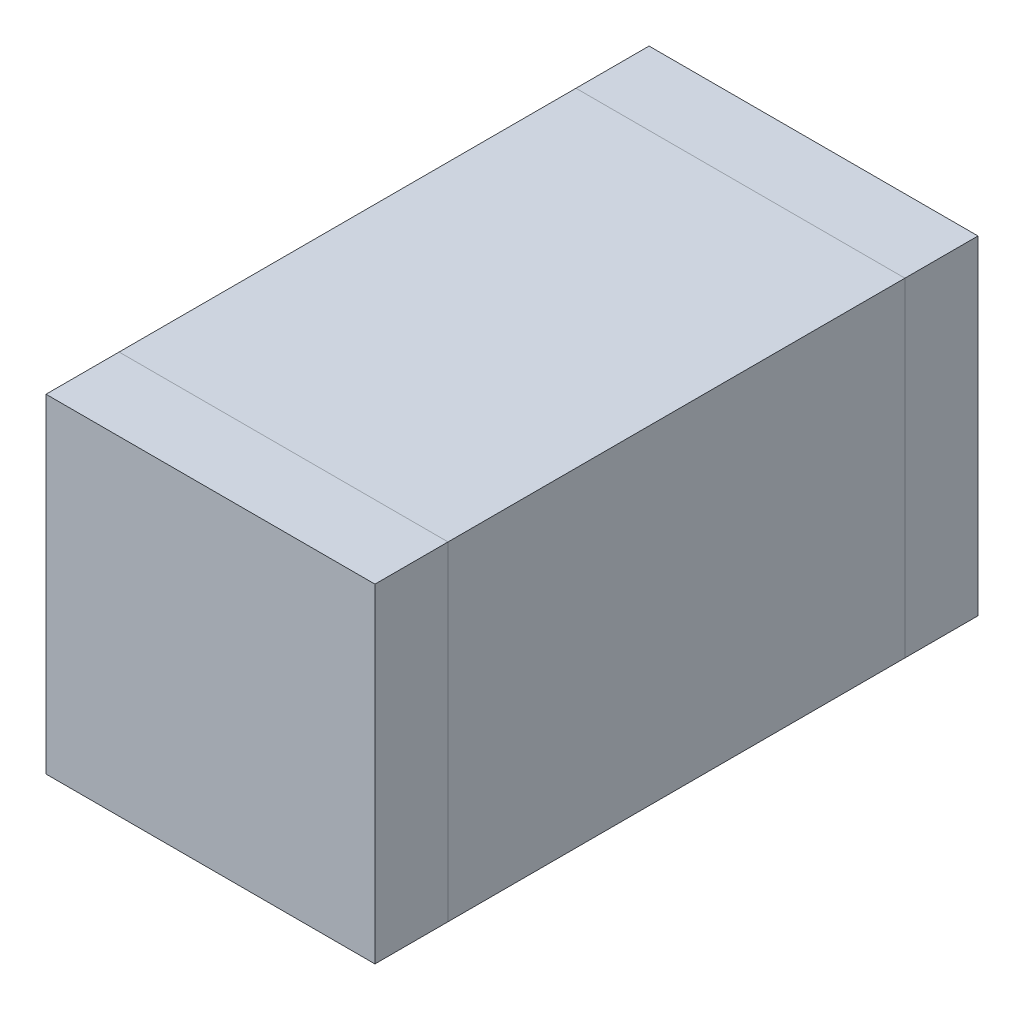
ISO-10303-21;
HEADER;
FILE_DESCRIPTION(('STEP AP214'),'2;1');
FILE_NAME('part.step','',(''),(''),'','','');
FILE_SCHEMA(('AUTOMOTIVE_DESIGN { 1 0 10303 214 1 1 1 1 }'));
ENDSEC;
DATA;
#1=APPLICATION_CONTEXT('core data for automotive mechanical design processes');
#2=APPLICATION_PROTOCOL_DEFINITION('international standard','automotive_design',2000,#1);
#3=PRODUCT_CONTEXT('',#1,'mechanical');
#4=PRODUCT('Part','Part','',(#3));
#5=PRODUCT_RELATED_PRODUCT_CATEGORY('part','',(#4));
#6=PRODUCT_DEFINITION_FORMATION('','',#4);
#7=PRODUCT_DEFINITION_CONTEXT('part definition',#1,'design');
#8=PRODUCT_DEFINITION('design','',#6,#7);
#9=PRODUCT_DEFINITION_SHAPE('','',#8);
#10=(LENGTH_UNIT() NAMED_UNIT(*) SI_UNIT(.MILLI.,.METRE.));
#11=(NAMED_UNIT(*) PLANE_ANGLE_UNIT() SI_UNIT($,.RADIAN.));
#12=(NAMED_UNIT(*) SI_UNIT($,.STERADIAN.) SOLID_ANGLE_UNIT());
#13=UNCERTAINTY_MEASURE_WITH_UNIT(LENGTH_MEASURE(1.E-05),#10,'distance_accuracy_value','');
#14=(GEOMETRIC_REPRESENTATION_CONTEXT(3) GLOBAL_UNCERTAINTY_ASSIGNED_CONTEXT((#13)) GLOBAL_UNIT_ASSIGNED_CONTEXT((#10,
#11,#12)) REPRESENTATION_CONTEXT('',''));
#15=CARTESIAN_POINT('',(0.,0.,0.));
#16=DIRECTION('',(0.,0.,1.));
#17=DIRECTION('',(1.,0.,0.));
#18=AXIS2_PLACEMENT_3D('',#15,#16,#17);
#19=CARTESIAN_POINT('',(0.9,1.8,-1.65));
#20=DIRECTION('',(-1.,0.,0.));
#21=DIRECTION('',(0.,0.,1.));
#22=AXIS2_PLACEMENT_3D('',#19,#20,#21);
#23=PLANE('',#22);
#24=DIRECTION('',(0.,-1.,0.));
#25=VECTOR('',#24,1.);
#26=CARTESIAN_POINT('',(0.9,1.8,-1.25));
#27=LINE('',#26,#25);
#28=CARTESIAN_POINT('',(0.9,1.8,-1.25));
#29=VERTEX_POINT('',#28);
#30=CARTESIAN_POINT('',(0.9,0.,-1.25));
#31=VERTEX_POINT('',#30);
#32=EDGE_CURVE('E108',#29,#31,#27,.T.);
#33=ORIENTED_EDGE('',*,*,#32,.T.);
#34=DIRECTION('',(0.,0.,1.));
#35=VECTOR('',#34,1.);
#36=CARTESIAN_POINT('',(0.9,0.,-1.65));
#37=LINE('',#36,#35);
#38=CARTESIAN_POINT('',(0.9,0.,-1.65));
#39=VERTEX_POINT('',#38);
#40=EDGE_CURVE('E12',#39,#31,#37,.T.);
#41=ORIENTED_EDGE('',*,*,#40,.F.);
#42=DIRECTION('',(0.,-1.,0.));
#43=VECTOR('',#42,1.);
#44=CARTESIAN_POINT('',(0.9,1.8,-1.65));
#45=LINE('',#44,#43);
#46=CARTESIAN_POINT('',(0.9,1.8,-1.65));
#47=VERTEX_POINT('',#46);
#48=EDGE_CURVE('E96',#47,#39,#45,.T.);
#49=ORIENTED_EDGE('',*,*,#48,.F.);
#50=DIRECTION('',(0.,0.,1.));
#51=VECTOR('',#50,1.);
#52=CARTESIAN_POINT('',(0.9,1.8,-1.65));
#53=LINE('',#52,#51);
#54=EDGE_CURVE('E104',#47,#29,#53,.T.);
#55=ORIENTED_EDGE('',*,*,#54,.T.);
#56=EDGE_LOOP('',(#33,#41,#49,#55));
#57=FACE_BOUND('',#56,.T.);
#58=ADVANCED_FACE('F45',(#57),#23,.F.);
#59=CARTESIAN_POINT('',(0.9,0.,-1.65));
#60=DIRECTION('',(0.,1.,0.));
#61=DIRECTION('',(0.,0.,1.));
#62=AXIS2_PLACEMENT_3D('',#59,#60,#61);
#63=PLANE('',#62);
#64=DIRECTION('',(-1.,0.,0.));
#65=VECTOR('',#64,1.);
#66=CARTESIAN_POINT('',(0.9,0.,-1.25));
#67=LINE('',#66,#65);
#68=CARTESIAN_POINT('',(-0.9,0.,-1.25));
#69=VERTEX_POINT('',#68);
#70=EDGE_CURVE('E100',#31,#69,#67,.T.);
#71=ORIENTED_EDGE('',*,*,#70,.T.);
#72=DIRECTION('',(0.,0.,1.));
#73=VECTOR('',#72,1.);
#74=CARTESIAN_POINT('',(-0.9,0.,-1.65));
#75=LINE('',#74,#73);
#76=CARTESIAN_POINT('',(-0.9,0.,-1.65));
#77=VERTEX_POINT('',#76);
#78=EDGE_CURVE('E53',#77,#69,#75,.T.);
#79=ORIENTED_EDGE('',*,*,#78,.F.);
#80=DIRECTION('',(-1.,0.,0.));
#81=VECTOR('',#80,1.);
#82=CARTESIAN_POINT('',(0.9,0.,-1.65));
#83=LINE('',#82,#81);
#84=EDGE_CURVE('E91',#39,#77,#83,.T.);
#85=ORIENTED_EDGE('',*,*,#84,.F.);
#86=ORIENTED_EDGE('',*,*,#40,.T.);
#87=EDGE_LOOP('',(#71,#79,#85,#86));
#88=FACE_BOUND('',#87,.T.);
#89=ADVANCED_FACE('F99',(#88),#63,.F.);
#90=CARTESIAN_POINT('',(-0.9,0.,-1.65));
#91=DIRECTION('',(1.,0.,0.));
#92=DIRECTION('',(0.,0.,-1.));
#93=AXIS2_PLACEMENT_3D('',#90,#91,#92);
#94=PLANE('',#93);
#95=DIRECTION('',(0.,1.,0.));
#96=VECTOR('',#95,1.);
#97=CARTESIAN_POINT('',(-0.9,0.,-1.25));
#98=LINE('',#97,#96);
#99=CARTESIAN_POINT('',(-0.9,1.8,-1.25));
#100=VERTEX_POINT('',#99);
#101=EDGE_CURVE('E78',#69,#100,#98,.T.);
#102=ORIENTED_EDGE('',*,*,#101,.T.);
#103=DIRECTION('',(0.,0.,1.));
#104=VECTOR('',#103,1.);
#105=CARTESIAN_POINT('',(-0.9,1.8,-1.65));
#106=LINE('',#105,#104);
#107=CARTESIAN_POINT('',(-0.9,1.8,-1.65));
#108=VERTEX_POINT('',#107);
#109=EDGE_CURVE('E101',#108,#100,#106,.T.);
#110=ORIENTED_EDGE('',*,*,#109,.F.);
#111=DIRECTION('',(0.,1.,0.));
#112=VECTOR('',#111,1.);
#113=CARTESIAN_POINT('',(-0.9,0.,-1.65));
#114=LINE('',#113,#112);
#115=EDGE_CURVE('E94',#77,#108,#114,.T.);
#116=ORIENTED_EDGE('',*,*,#115,.F.);
#117=ORIENTED_EDGE('',*,*,#78,.T.);
#118=EDGE_LOOP('',(#102,#110,#116,#117));
#119=FACE_BOUND('',#118,.T.);
#120=ADVANCED_FACE('F102',(#119),#94,.F.);
#121=CARTESIAN_POINT('',(-0.9,1.8,-1.65));
#122=DIRECTION('',(0.,-1.,0.));
#123=DIRECTION('',(0.,0.,-1.));
#124=AXIS2_PLACEMENT_3D('',#121,#122,#123);
#125=PLANE('',#124);
#126=DIRECTION('',(1.,0.,0.));
#127=VECTOR('',#126,1.);
#128=CARTESIAN_POINT('',(-0.9,1.8,-1.25));
#129=LINE('',#128,#127);
#130=EDGE_CURVE('E84',#100,#29,#129,.T.);
#131=ORIENTED_EDGE('',*,*,#130,.T.);
#132=ORIENTED_EDGE('',*,*,#54,.F.);
#133=DIRECTION('',(1.,0.,0.));
#134=VECTOR('',#133,1.);
#135=CARTESIAN_POINT('',(-0.9,1.8,-1.65));
#136=LINE('',#135,#134);
#137=EDGE_CURVE('E61',#108,#47,#136,.T.);
#138=ORIENTED_EDGE('',*,*,#137,.F.);
#139=ORIENTED_EDGE('',*,*,#109,.T.);
#140=EDGE_LOOP('',(#131,#132,#138,#139));
#141=FACE_BOUND('',#140,.T.);
#142=ADVANCED_FACE('F115',(#141),#125,.F.);
#143=CARTESIAN_POINT('',(0.,0.,-1.65));
#144=DIRECTION('',(0.,0.,-1.));
#145=DIRECTION('',(-1.,0.,0.));
#146=AXIS2_PLACEMENT_3D('',#143,#144,#145);
#147=PLANE('',#146);
#148=ORIENTED_EDGE('',*,*,#48,.T.);
#149=ORIENTED_EDGE('',*,*,#84,.T.);
#150=ORIENTED_EDGE('',*,*,#115,.T.);
#151=ORIENTED_EDGE('',*,*,#137,.T.);
#152=EDGE_LOOP('',(#148,#149,#150,#151));
#153=FACE_BOUND('',#152,.T.);
#154=ADVANCED_FACE('F92',(#153),#147,.T.);
#155=CARTESIAN_POINT('',(0.,0.,-1.25));
#156=DIRECTION('',(0.,0.,-1.));
#157=DIRECTION('',(-1.,0.,0.));
#158=AXIS2_PLACEMENT_3D('',#155,#156,#157);
#159=PLANE('',#158);
#160=ORIENTED_EDGE('',*,*,#32,.F.);
#161=ORIENTED_EDGE('',*,*,#130,.F.);
#162=ORIENTED_EDGE('',*,*,#101,.F.);
#163=ORIENTED_EDGE('',*,*,#70,.F.);
#164=EDGE_LOOP('',(#160,#161,#162,#163));
#165=FACE_BOUND('',#164,.T.);
#166=ADVANCED_FACE('F118',(#165),#159,.F.);
#167=CLOSED_SHELL('',(#58,#89,#120,#142,#154,#166));
#168=MANIFOLD_SOLID_BREP('B2',#167);
#169=CARTESIAN_POINT('',(-0.9,1.8,1.65));
#170=DIRECTION('',(1.,0.,0.));
#171=DIRECTION('',(0.,0.,-1.));
#172=AXIS2_PLACEMENT_3D('',#169,#170,#171);
#173=PLANE('',#172);
#174=DIRECTION('',(0.,-1.,0.));
#175=VECTOR('',#174,1.);
#176=CARTESIAN_POINT('',(-0.9,1.8,1.25));
#177=LINE('',#176,#175);
#178=CARTESIAN_POINT('',(-0.9,1.8,1.25));
#179=VERTEX_POINT('',#178);
#180=CARTESIAN_POINT('',(-0.9,0.,1.25));
#181=VERTEX_POINT('',#180);
#182=EDGE_CURVE('E240',#179,#181,#177,.T.);
#183=ORIENTED_EDGE('',*,*,#182,.T.);
#184=DIRECTION('',(0.,0.,-1.));
#185=VECTOR('',#184,1.);
#186=CARTESIAN_POINT('',(-0.9,0.,1.65));
#187=LINE('',#186,#185);
#188=CARTESIAN_POINT('',(-0.9,0.,1.65));
#189=VERTEX_POINT('',#188);
#190=EDGE_CURVE('E43',#189,#181,#187,.T.);
#191=ORIENTED_EDGE('',*,*,#190,.F.);
#192=DIRECTION('',(0.,-1.,0.));
#193=VECTOR('',#192,1.);
#194=CARTESIAN_POINT('',(-0.9,1.8,1.65));
#195=LINE('',#194,#193);
#196=CARTESIAN_POINT('',(-0.9,1.8,1.65));
#197=VERTEX_POINT('',#196);
#198=EDGE_CURVE('E228',#197,#189,#195,.T.);
#199=ORIENTED_EDGE('',*,*,#198,.F.);
#200=DIRECTION('',(0.,0.,-1.));
#201=VECTOR('',#200,1.);
#202=CARTESIAN_POINT('',(-0.9,1.8,1.65));
#203=LINE('',#202,#201);
#204=EDGE_CURVE('E236',#197,#179,#203,.T.);
#205=ORIENTED_EDGE('',*,*,#204,.T.);
#206=EDGE_LOOP('',(#183,#191,#199,#205));
#207=FACE_BOUND('',#206,.T.);
#208=ADVANCED_FACE('F177',(#207),#173,.F.);
#209=CARTESIAN_POINT('',(-0.9,0.,1.65));
#210=DIRECTION('',(0.,1.,0.));
#211=DIRECTION('',(0.,0.,1.));
#212=AXIS2_PLACEMENT_3D('',#209,#210,#211);
#213=PLANE('',#212);
#214=DIRECTION('',(1.,0.,0.));
#215=VECTOR('',#214,1.);
#216=CARTESIAN_POINT('',(-0.9,0.,1.25));
#217=LINE('',#216,#215);
#218=CARTESIAN_POINT('',(0.9,0.,1.25));
#219=VERTEX_POINT('',#218);
#220=EDGE_CURVE('E232',#181,#219,#217,.T.);
#221=ORIENTED_EDGE('',*,*,#220,.T.);
#222=DIRECTION('',(0.,0.,-1.));
#223=VECTOR('',#222,1.);
#224=CARTESIAN_POINT('',(0.9,0.,1.65));
#225=LINE('',#224,#223);
#226=CARTESIAN_POINT('',(0.9,0.,1.65));
#227=VERTEX_POINT('',#226);
#228=EDGE_CURVE('E185',#227,#219,#225,.T.);
#229=ORIENTED_EDGE('',*,*,#228,.F.);
#230=DIRECTION('',(1.,0.,0.));
#231=VECTOR('',#230,1.);
#232=CARTESIAN_POINT('',(-0.9,0.,1.65));
#233=LINE('',#232,#231);
#234=EDGE_CURVE('E223',#189,#227,#233,.T.);
#235=ORIENTED_EDGE('',*,*,#234,.F.);
#236=ORIENTED_EDGE('',*,*,#190,.T.);
#237=EDGE_LOOP('',(#221,#229,#235,#236));
#238=FACE_BOUND('',#237,.T.);
#239=ADVANCED_FACE('F231',(#238),#213,.F.);
#240=CARTESIAN_POINT('',(0.9,0.,1.65));
#241=DIRECTION('',(-1.,0.,0.));
#242=DIRECTION('',(0.,0.,1.));
#243=AXIS2_PLACEMENT_3D('',#240,#241,#242);
#244=PLANE('',#243);
#245=DIRECTION('',(0.,1.,0.));
#246=VECTOR('',#245,1.);
#247=CARTESIAN_POINT('',(0.9,0.,1.25));
#248=LINE('',#247,#246);
#249=CARTESIAN_POINT('',(0.9,1.8,1.25));
#250=VERTEX_POINT('',#249);
#251=EDGE_CURVE('E210',#219,#250,#248,.T.);
#252=ORIENTED_EDGE('',*,*,#251,.T.);
#253=DIRECTION('',(0.,0.,-1.));
#254=VECTOR('',#253,1.);
#255=CARTESIAN_POINT('',(0.9,1.8,1.65));
#256=LINE('',#255,#254);
#257=CARTESIAN_POINT('',(0.9,1.8,1.65));
#258=VERTEX_POINT('',#257);
#259=EDGE_CURVE('E233',#258,#250,#256,.T.);
#260=ORIENTED_EDGE('',*,*,#259,.F.);
#261=DIRECTION('',(0.,1.,0.));
#262=VECTOR('',#261,1.);
#263=CARTESIAN_POINT('',(0.9,0.,1.65));
#264=LINE('',#263,#262);
#265=EDGE_CURVE('E226',#227,#258,#264,.T.);
#266=ORIENTED_EDGE('',*,*,#265,.F.);
#267=ORIENTED_EDGE('',*,*,#228,.T.);
#268=EDGE_LOOP('',(#252,#260,#266,#267));
#269=FACE_BOUND('',#268,.T.);
#270=ADVANCED_FACE('F234',(#269),#244,.F.);
#271=CARTESIAN_POINT('',(0.9,1.8,1.65));
#272=DIRECTION('',(0.,-1.,0.));
#273=DIRECTION('',(0.,0.,-1.));
#274=AXIS2_PLACEMENT_3D('',#271,#272,#273);
#275=PLANE('',#274);
#276=DIRECTION('',(-1.,0.,0.));
#277=VECTOR('',#276,1.);
#278=CARTESIAN_POINT('',(0.9,1.8,1.25));
#279=LINE('',#278,#277);
#280=EDGE_CURVE('E216',#250,#179,#279,.T.);
#281=ORIENTED_EDGE('',*,*,#280,.T.);
#282=ORIENTED_EDGE('',*,*,#204,.F.);
#283=DIRECTION('',(-1.,0.,0.));
#284=VECTOR('',#283,1.);
#285=CARTESIAN_POINT('',(0.9,1.8,1.65));
#286=LINE('',#285,#284);
#287=EDGE_CURVE('E193',#258,#197,#286,.T.);
#288=ORIENTED_EDGE('',*,*,#287,.F.);
#289=ORIENTED_EDGE('',*,*,#259,.T.);
#290=EDGE_LOOP('',(#281,#282,#288,#289));
#291=FACE_BOUND('',#290,.T.);
#292=ADVANCED_FACE('F247',(#291),#275,.F.);
#293=CARTESIAN_POINT('',(0.,0.,1.65));
#294=DIRECTION('',(0.,0.,1.));
#295=DIRECTION('',(1.,0.,0.));
#296=AXIS2_PLACEMENT_3D('',#293,#294,#295);
#297=PLANE('',#296);
#298=ORIENTED_EDGE('',*,*,#198,.T.);
#299=ORIENTED_EDGE('',*,*,#234,.T.);
#300=ORIENTED_EDGE('',*,*,#265,.T.);
#301=ORIENTED_EDGE('',*,*,#287,.T.);
#302=EDGE_LOOP('',(#298,#299,#300,#301));
#303=FACE_BOUND('',#302,.T.);
#304=ADVANCED_FACE('F224',(#303),#297,.T.);
#305=CARTESIAN_POINT('',(0.,0.,1.25));
#306=DIRECTION('',(0.,0.,1.));
#307=DIRECTION('',(1.,0.,0.));
#308=AXIS2_PLACEMENT_3D('',#305,#306,#307);
#309=PLANE('',#308);
#310=ORIENTED_EDGE('',*,*,#182,.F.);
#311=ORIENTED_EDGE('',*,*,#280,.F.);
#312=ORIENTED_EDGE('',*,*,#251,.F.);
#313=ORIENTED_EDGE('',*,*,#220,.F.);
#314=EDGE_LOOP('',(#310,#311,#312,#313));
#315=FACE_BOUND('',#314,.T.);
#316=ADVANCED_FACE('F250',(#315),#309,.F.);
#317=CLOSED_SHELL('',(#208,#239,#270,#292,#304,#316));
#318=MANIFOLD_SOLID_BREP('B6',#317);
#319=CARTESIAN_POINT('',(0.9,1.8,-1.25));
#320=DIRECTION('',(-1.,0.,0.));
#321=DIRECTION('',(0.,0.,1.));
#322=AXIS2_PLACEMENT_3D('',#319,#320,#321);
#323=PLANE('',#322);
#324=DIRECTION('',(0.,0.,-1.));
#325=VECTOR('',#324,1.);
#326=CARTESIAN_POINT('',(0.9,0.,-1.25));
#327=LINE('',#326,#325);
#328=CARTESIAN_POINT('',(0.9,0.,1.25));
#329=VERTEX_POINT('',#328);
#330=CARTESIAN_POINT('',(0.9,0.,-1.25));
#331=VERTEX_POINT('',#330);
#332=EDGE_CURVE('E363',#329,#331,#327,.T.);
#333=ORIENTED_EDGE('',*,*,#332,.T.);
#334=DIRECTION('',(0.,-1.,0.));
#335=VECTOR('',#334,1.);
#336=CARTESIAN_POINT('',(0.9,1.8,-1.25));
#337=LINE('',#336,#335);
#338=CARTESIAN_POINT('',(0.9,1.8,-1.25));
#339=VERTEX_POINT('',#338);
#340=EDGE_CURVE('E175',#339,#331,#337,.T.);
#341=ORIENTED_EDGE('',*,*,#340,.F.);
#342=DIRECTION('',(0.,0.,-1.));
#343=VECTOR('',#342,1.);
#344=CARTESIAN_POINT('',(0.9,1.8,-1.25));
#345=LINE('',#344,#343);
#346=CARTESIAN_POINT('',(0.9,1.8,1.25));
#347=VERTEX_POINT('',#346);
#348=EDGE_CURVE('E351',#347,#339,#345,.T.);
#349=ORIENTED_EDGE('',*,*,#348,.F.);
#350=DIRECTION('',(0.,-1.,0.));
#351=VECTOR('',#350,1.);
#352=CARTESIAN_POINT('',(0.9,1.8,1.25));
#353=LINE('',#352,#351);
#354=EDGE_CURVE('E359',#347,#329,#353,.T.);
#355=ORIENTED_EDGE('',*,*,#354,.T.);
#356=EDGE_LOOP('',(#333,#341,#349,#355));
#357=FACE_BOUND('',#356,.T.);
#358=ADVANCED_FACE('F300',(#357),#323,.F.);
#359=CARTESIAN_POINT('',(-0.9,1.8,-1.25));
#360=DIRECTION('',(0.,0.,1.));
#361=DIRECTION('',(1.,0.,0.));
#362=AXIS2_PLACEMENT_3D('',#359,#360,#361);
#363=PLANE('',#362);
#364=DIRECTION('',(-1.,0.,0.));
#365=VECTOR('',#364,1.);
#366=CARTESIAN_POINT('',(-0.9,0.,-1.25));
#367=LINE('',#366,#365);
#368=CARTESIAN_POINT('',(-0.9,0.,-1.25));
#369=VERTEX_POINT('',#368);
#370=EDGE_CURVE('E355',#331,#369,#367,.T.);
#371=ORIENTED_EDGE('',*,*,#370,.T.);
#372=DIRECTION('',(0.,-1.,0.));
#373=VECTOR('',#372,1.);
#374=CARTESIAN_POINT('',(-0.9,1.8,-1.25));
#375=LINE('',#374,#373);
#376=CARTESIAN_POINT('',(-0.9,1.8,-1.25));
#377=VERTEX_POINT('',#376);
#378=EDGE_CURVE('E308',#377,#369,#375,.T.);
#379=ORIENTED_EDGE('',*,*,#378,.F.);
#380=DIRECTION('',(-1.,0.,0.));
#381=VECTOR('',#380,1.);
#382=CARTESIAN_POINT('',(-0.9,1.8,-1.25));
#383=LINE('',#382,#381);
#384=EDGE_CURVE('E346',#339,#377,#383,.T.);
#385=ORIENTED_EDGE('',*,*,#384,.F.);
#386=ORIENTED_EDGE('',*,*,#340,.T.);
#387=EDGE_LOOP('',(#371,#379,#385,#386));
#388=FACE_BOUND('',#387,.T.);
#389=ADVANCED_FACE('F354',(#388),#363,.F.);
#390=CARTESIAN_POINT('',(-0.9,1.8,-1.25));
#391=DIRECTION('',(1.,0.,0.));
#392=DIRECTION('',(0.,0.,-1.));
#393=AXIS2_PLACEMENT_3D('',#390,#391,#392);
#394=PLANE('',#393);
#395=DIRECTION('',(0.,0.,1.));
#396=VECTOR('',#395,1.);
#397=CARTESIAN_POINT('',(-0.9,0.,-1.25));
#398=LINE('',#397,#396);
#399=CARTESIAN_POINT('',(-0.9,0.,1.25));
#400=VERTEX_POINT('',#399);
#401=EDGE_CURVE('E333',#369,#400,#398,.T.);
#402=ORIENTED_EDGE('',*,*,#401,.T.);
#403=DIRECTION('',(0.,-1.,0.));
#404=VECTOR('',#403,1.);
#405=CARTESIAN_POINT('',(-0.9,1.8,1.25));
#406=LINE('',#405,#404);
#407=CARTESIAN_POINT('',(-0.9,1.8,1.25));
#408=VERTEX_POINT('',#407);
#409=EDGE_CURVE('E356',#408,#400,#406,.T.);
#410=ORIENTED_EDGE('',*,*,#409,.F.);
#411=DIRECTION('',(0.,0.,1.));
#412=VECTOR('',#411,1.);
#413=CARTESIAN_POINT('',(-0.9,1.8,-1.25));
#414=LINE('',#413,#412);
#415=EDGE_CURVE('E349',#377,#408,#414,.T.);
#416=ORIENTED_EDGE('',*,*,#415,.F.);
#417=ORIENTED_EDGE('',*,*,#378,.T.);
#418=EDGE_LOOP('',(#402,#410,#416,#417));
#419=FACE_BOUND('',#418,.T.);
#420=ADVANCED_FACE('F357',(#419),#394,.F.);
#421=CARTESIAN_POINT('',(-0.9,1.8,1.25));
#422=DIRECTION('',(0.,0.,-1.));
#423=DIRECTION('',(-1.,0.,0.));
#424=AXIS2_PLACEMENT_3D('',#421,#422,#423);
#425=PLANE('',#424);
#426=DIRECTION('',(1.,0.,0.));
#427=VECTOR('',#426,1.);
#428=CARTESIAN_POINT('',(-0.9,0.,1.25));
#429=LINE('',#428,#427);
#430=EDGE_CURVE('E339',#400,#329,#429,.T.);
#431=ORIENTED_EDGE('',*,*,#430,.T.);
#432=ORIENTED_EDGE('',*,*,#354,.F.);
#433=DIRECTION('',(1.,0.,0.));
#434=VECTOR('',#433,1.);
#435=CARTESIAN_POINT('',(-0.9,1.8,1.25));
#436=LINE('',#435,#434);
#437=EDGE_CURVE('E316',#408,#347,#436,.T.);
#438=ORIENTED_EDGE('',*,*,#437,.F.);
#439=ORIENTED_EDGE('',*,*,#409,.T.);
#440=EDGE_LOOP('',(#431,#432,#438,#439));
#441=FACE_BOUND('',#440,.T.);
#442=ADVANCED_FACE('F370',(#441),#425,.F.);
#443=CARTESIAN_POINT('',(0.,1.8,0.));
#444=DIRECTION('',(0.,1.,0.));
#445=DIRECTION('',(0.,0.,1.));
#446=AXIS2_PLACEMENT_3D('',#443,#444,#445);
#447=PLANE('',#446);
#448=ORIENTED_EDGE('',*,*,#348,.T.);
#449=ORIENTED_EDGE('',*,*,#384,.T.);
#450=ORIENTED_EDGE('',*,*,#415,.T.);
#451=ORIENTED_EDGE('',*,*,#437,.T.);
#452=EDGE_LOOP('',(#448,#449,#450,#451));
#453=FACE_BOUND('',#452,.T.);
#454=ADVANCED_FACE('F347',(#453),#447,.T.);
#455=CARTESIAN_POINT('',(0.,0.,0.));
#456=DIRECTION('',(0.,1.,0.));
#457=DIRECTION('',(0.,0.,1.));
#458=AXIS2_PLACEMENT_3D('',#455,#456,#457);
#459=PLANE('',#458);
#460=ORIENTED_EDGE('',*,*,#332,.F.);
#461=ORIENTED_EDGE('',*,*,#430,.F.);
#462=ORIENTED_EDGE('',*,*,#401,.F.);
#463=ORIENTED_EDGE('',*,*,#370,.F.);
#464=EDGE_LOOP('',(#460,#461,#462,#463));
#465=FACE_BOUND('',#464,.T.);
#466=ADVANCED_FACE('F373',(#465),#459,.F.);
#467=CLOSED_SHELL('',(#358,#389,#420,#442,#454,#466));
#468=MANIFOLD_SOLID_BREP('B37',#467);
#469=ADVANCED_BREP_SHAPE_REPRESENTATION('',(#18,#168,#318,#468),#14);
#470=SHAPE_DEFINITION_REPRESENTATION(#9,#469);
ENDSEC;
END-ISO-10303-21;
